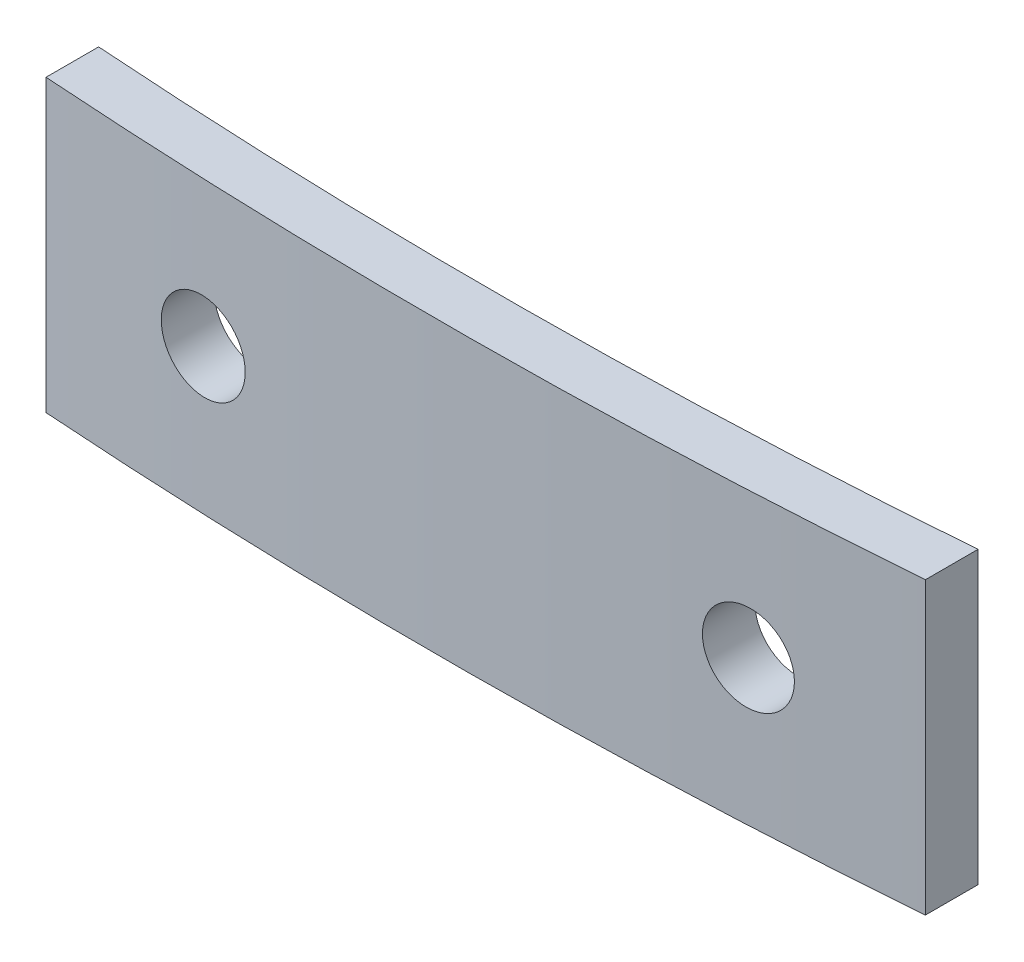
ISO-10303-21;
HEADER;
FILE_DESCRIPTION(('STEP AP214'),'2;1');
FILE_NAME('part.step','',(''),(''),'','','');
FILE_SCHEMA(('AUTOMOTIVE_DESIGN { 1 0 10303 214 1 1 1 1 }'));
ENDSEC;
DATA;
#1=APPLICATION_CONTEXT('core data for automotive mechanical design processes');
#2=APPLICATION_PROTOCOL_DEFINITION('international standard','automotive_design',2000,#1);
#3=PRODUCT_CONTEXT('',#1,'mechanical');
#4=PRODUCT('Part','Part','',(#3));
#5=PRODUCT_RELATED_PRODUCT_CATEGORY('part','',(#4));
#6=PRODUCT_DEFINITION_FORMATION('','',#4);
#7=PRODUCT_DEFINITION_CONTEXT('part definition',#1,'design');
#8=PRODUCT_DEFINITION('design','',#6,#7);
#9=PRODUCT_DEFINITION_SHAPE('','',#8);
#10=(LENGTH_UNIT() NAMED_UNIT(*) SI_UNIT(.MILLI.,.METRE.));
#11=(NAMED_UNIT(*) PLANE_ANGLE_UNIT() SI_UNIT($,.RADIAN.));
#12=(NAMED_UNIT(*) SI_UNIT($,.STERADIAN.) SOLID_ANGLE_UNIT());
#13=UNCERTAINTY_MEASURE_WITH_UNIT(LENGTH_MEASURE(1.E-05),#10,'distance_accuracy_value','');
#14=(GEOMETRIC_REPRESENTATION_CONTEXT(3) GLOBAL_UNCERTAINTY_ASSIGNED_CONTEXT((#13)) GLOBAL_UNIT_ASSIGNED_CONTEXT((#10,
#11,#12)) REPRESENTATION_CONTEXT('',''));
#15=CARTESIAN_POINT('',(0.,0.,0.));
#16=DIRECTION('',(0.,0.,1.));
#17=DIRECTION('',(1.,0.,0.));
#18=AXIS2_PLACEMENT_3D('',#15,#16,#17);
#19=CARTESIAN_POINT('',(-0.864955357188,8.3,-164.510629845193));
#20=DIRECTION('',(0.,-1.,0.));
#21=DIRECTION('',(0.,0.,-1.));
#22=AXIS2_PLACEMENT_3D('',#19,#20,#21);
#23=CYLINDRICAL_SURFACE('',#22,167.210703971618);
#24=CARTESIAN_POINT('',(-0.864955357188,0.,-164.510629845193));
#25=DIRECTION('',(0.,-1.,0.));
#26=DIRECTION('',(0.,0.,1.));
#27=AXIS2_PLACEMENT_3D('',#24,#25,#26);
#28=CIRCLE('',#27,167.210703971618);
#29=CARTESIAN_POINT('',(12.5,0.,2.16509571490275));
#30=VERTEX_POINT('',#29);
#31=CARTESIAN_POINT('',(-12.5,0.,2.29478151440213));
#32=VERTEX_POINT('',#31);
#33=EDGE_CURVE('E117',#30,#32,#28,.T.);
#34=ORIENTED_EDGE('',*,*,#33,.T.);
#35=DIRECTION('',(0.,-1.,0.));
#36=VECTOR('',#35,1.);
#37=CARTESIAN_POINT('',(-12.5,8.3,2.29478151440213));
#38=LINE('',#37,#36);
#39=CARTESIAN_POINT('',(-12.5,8.3,2.29478151440213));
#40=VERTEX_POINT('',#39);
#41=EDGE_CURVE('E11',#40,#32,#38,.T.);
#42=ORIENTED_EDGE('',*,*,#41,.F.);
#43=CARTESIAN_POINT('',(-0.864955357188,8.3,-164.510629845193));
#44=DIRECTION('',(0.,-1.,0.));
#45=DIRECTION('',(0.,0.,1.));
#46=AXIS2_PLACEMENT_3D('',#43,#44,#45);
#47=CIRCLE('',#46,167.210703971618);
#48=CARTESIAN_POINT('',(12.5,8.3,2.16509571490275));
#49=VERTEX_POINT('',#48);
#50=EDGE_CURVE('E99',#49,#40,#47,.T.);
#51=ORIENTED_EDGE('',*,*,#50,.F.);
#52=DIRECTION('',(0.,-1.,0.));
#53=VECTOR('',#52,1.);
#54=CARTESIAN_POINT('',(12.5,8.3,2.16509571490275));
#55=LINE('',#54,#53);
#56=EDGE_CURVE('E113',#49,#30,#55,.T.);
#57=ORIENTED_EDGE('',*,*,#56,.T.);
#58=EDGE_LOOP('',(#34,#42,#51,#57));
#59=FACE_BOUND('',#58,.T.);
#60=CARTESIAN_POINT('',(6.5,4.15,2.53779713115004));
#61=CARTESIAN_POINT('',(6.50000311830072,4.2201600528483,2.53779703356888));
#62=CARTESIAN_POINT('',(6.50592683250922,4.29037097447346,2.53753615101918));
#63=CARTESIAN_POINT('',(6.52947445822004,4.42885834488722,2.53649543364698));
#64=CARTESIAN_POINT('',(6.54711244591845,4.49713236319745,2.5357149744841));
#65=CARTESIAN_POINT('',(6.593583155423,4.6297187466707,2.53364651229168));
#66=CARTESIAN_POINT('',(6.62241033254543,4.69403305576497,2.53235876064082));
#67=CARTESIAN_POINT('',(6.69042977820944,4.81688874962342,2.52929601535595));
#68=CARTESIAN_POINT('',(6.72961948369922,4.87543155699319,2.52752114220171));
#69=CARTESIAN_POINT('',(6.81727240701778,4.98513523567161,2.52351282987057));
#70=CARTESIAN_POINT('',(6.86574015724651,5.03629247755706,2.52127916653188));
#71=CARTESIAN_POINT('',(6.97055942325953,5.12974635220956,2.51639484759461));
#72=CARTESIAN_POINT('',(7.02691128046353,5.17204260105485,2.51374417393686));
#73=CARTESIAN_POINT('',(7.14595131480201,5.24661412268197,2.50807702763504));
#74=CARTESIAN_POINT('',(7.2086452692116,5.27888014756526,2.50506022095671));
#75=CARTESIAN_POINT('',(7.33854573429652,5.33243009041771,2.49873012293615));
#76=CARTESIAN_POINT('',(7.40575226418267,5.35371396163058,2.4954168303317));
#77=CARTESIAN_POINT('',(7.5428494216453,5.38471994256582,2.4885709153848));
#78=CARTESIAN_POINT('',(7.61274294738313,5.39442918509865,2.48503805353334));
#79=CARTESIAN_POINT('',(7.7531616222027,5.40197190758309,2.47785036870086));
#80=CARTESIAN_POINT('',(7.82368677376782,5.39980534082174,2.47419554524016));
#81=CARTESIAN_POINT('',(7.96342985722233,5.38365274089719,2.46686575840938));
#82=CARTESIAN_POINT('',(8.0326466378837,5.36965675272819,2.46319078066725));
#83=CARTESIAN_POINT('',(8.16774794433558,5.33022812559369,2.45593678797151));
#84=CARTESIAN_POINT('',(8.23363245930642,5.30479544949665,2.45235777332949));
#85=CARTESIAN_POINT('',(8.36020377089505,5.24320862112569,2.44541222559091));
#86=CARTESIAN_POINT('',(8.42089009855844,5.20705350283695,2.4420457116723));
#87=CARTESIAN_POINT('',(8.53533088617573,5.12504404492505,2.43564124626815));
#88=CARTESIAN_POINT('',(8.58908537368798,5.07918974386402,2.4326032934764));
#89=CARTESIAN_POINT('',(8.68808413564137,4.97912437454379,2.42696754118702));
#90=CARTESIAN_POINT('',(8.73333590873341,4.92492074717713,2.42436935405706));
#91=CARTESIAN_POINT('',(8.81409389396076,4.80966323539121,2.41970643279685));
#92=CARTESIAN_POINT('',(8.8496001867816,4.74860940769255,2.41764169425003));
#93=CARTESIAN_POINT('',(8.90980168821073,4.62148553155661,2.41412733536457));
#94=CARTESIAN_POINT('',(8.93451353604402,4.55542338906069,2.41267676841059));
#95=CARTESIAN_POINT('',(8.97249675193018,4.4200775166296,2.41044259271686));
#96=CARTESIAN_POINT('',(8.98576822175059,4.3507938153575,2.40965897804425));
#97=CARTESIAN_POINT('',(9.00047882200267,4.21107570744998,2.4087901949542));
#98=CARTESIAN_POINT('',(9.00193452056621,4.14064305088972,2.40870404854379));
#99=CARTESIAN_POINT('',(8.9930154142881,4.00053370594098,2.40923102871897));
#100=CARTESIAN_POINT('',(8.98264065708287,3.93085701450969,2.40984415248887));
#101=CARTESIAN_POINT('',(8.9503655620009,3.79426844369779,2.41174509717095));
#102=CARTESIAN_POINT('',(8.92847026623645,3.72735536859114,2.4130326229213));
#103=CARTESIAN_POINT('',(8.8737837915955,3.59815694385367,2.4162320685688));
#104=CARTESIAN_POINT('',(8.84099258100937,3.53587160769127,2.41814399028308));
#105=CARTESIAN_POINT('',(8.76541982221783,3.41764155961199,2.42252092143321));
#106=CARTESIAN_POINT('',(8.72263037518888,3.36170191310341,2.42498636810516));
#107=CARTESIAN_POINT('',(8.62829367522125,3.2577981137888,2.43037761471364));
#108=CARTESIAN_POINT('',(8.57674634798289,3.20983402865227,2.43330341855572));
#109=CARTESIAN_POINT('',(8.46627103909551,3.12316384761996,2.43951479784418));
#110=CARTESIAN_POINT('',(8.40733179566604,3.08447214599152,2.4428009212656));
#111=CARTESIAN_POINT('',(8.28380750137,3.01753168134166,2.44961536945369));
#112=CARTESIAN_POINT('',(8.21922240939069,2.98928299437351,2.45314369598402));
#113=CARTESIAN_POINT('',(8.08614019581266,2.94399119053169,2.46033126551108));
#114=CARTESIAN_POINT('',(8.0176376688324,2.92696398359887,2.46399068666331));
#115=CARTESIAN_POINT('',(7.87874601955412,2.90466003783105,2.47132140491645));
#116=CARTESIAN_POINT('',(7.80835688551057,2.89938337216909,2.47499270209117));
#117=CARTESIAN_POINT('',(7.66764528599877,2.90073180929488,2.48224190393867));
#118=CARTESIAN_POINT('',(7.59732288570206,2.90736404166644,2.48581975136414));
#119=CARTESIAN_POINT('',(7.45878462599334,2.93235966108019,2.49278235889512));
#120=CARTESIAN_POINT('',(7.39056876893537,2.95072306123143,2.49616711878486));
#121=CARTESIAN_POINT('',(7.25820669782941,2.99865642610158,2.5026575116878));
#122=CARTESIAN_POINT('',(7.19405912200034,3.02822261753584,2.50576323824877));
#123=CARTESIAN_POINT('',(7.07163847251114,3.09772642357956,2.51162544242854));
#124=CARTESIAN_POINT('',(7.01336514139768,3.13766358338107,2.51438193535473));
#125=CARTESIAN_POINT('',(6.9044123768105,3.2267300456736,2.5194854771111));
#126=CARTESIAN_POINT('',(6.85372481706355,3.27584938297113,2.52183296453855));
#127=CARTESIAN_POINT('',(6.76130334568271,3.38193224768082,2.5260782387648));
#128=CARTESIAN_POINT('',(6.71957161192582,3.43889767758814,2.52797591619053));
#129=CARTESIAN_POINT('',(6.64629504219877,3.55899830925378,2.53128701689445));
#130=CARTESIAN_POINT('',(6.614743919168,3.62212967172133,2.53270073907335));
#131=CARTESIAN_POINT('',(6.56272376021015,3.75275215207936,2.53502196922212));
#132=CARTESIAN_POINT('',(6.54224136968559,3.82023790573416,2.5359300872515));
#133=CARTESIAN_POINT('',(6.51840966169869,3.93179630078508,2.53698468836411));
#134=CARTESIAN_POINT('',(6.51151470431355,3.97514204431732,2.53728912928755));
#135=CARTESIAN_POINT('',(6.50230890007655,4.06231856832874,2.53769538112666));
#136=CARTESIAN_POINT('',(6.49999805103457,4.10614934857616,2.53779719213913));
#137=CARTESIAN_POINT('',(6.5,4.15,2.53779713115004));
#138=B_SPLINE_CURVE_WITH_KNOTS('',3,(#60,#61,#62,#63,#64,#65,#66,#67,#68,#69,#70,#71,#72,#73,
#74,#75,#76,#77,#78,#79,#80,#81,#82,#83,#84,#85,#86,#87,#88,#89,#90,#91,#92,#93,#94,#95,#96,#97,
#98,#99,#100,#101,#102,#103,#104,#105,#106,#107,#108,#109,#110,#111,#112,#113,#114,#115,#116,
#117,#118,#119,#120,#121,#122,#123,#124,#125,#126,#127,#128,#129,#130,#131,#132,#133,#134,#135,
#136,#137),.UNSPECIFIED.,.T.,.F.,(4,2,2,2,2,2,2,2,2,2,2,2,2,2,2,2,2,2,2,2,2,2,2,2,2,2,2,2,2,2,2,
2,2,2,2,2,2,2,4),(0.,0.210320035472163,0.420893255693905,0.631362261542145,0.841779258925773,
1.05229931024653,1.2628284809202,1.47355118835342,1.68427479292679,1.89523243521323,
2.10619090729285,2.31732708766128,2.52846395353147,2.7396198470939,2.95077490115542,
3.1617428517856,3.37270905570111,3.58334890570873,3.79398688195663,4.00432944949815,
4.21467117007918,4.424920908374,4.63517125854935,4.84558827603943,5.05600707874424,
5.26675044568951,5.47749534738359,5.68853840640857,5.89958277963837,6.11075354241696,
6.32192454116966,6.53302447718547,6.74411515719746,6.95497806183269,7.16589218613083,
7.3766758095064,7.58720454814038,7.71865648688288,7.8501083628226),.UNSPECIFIED.);
#139=CARTESIAN_POINT('',(6.5,4.15,2.53779713115004));
#140=VERTEX_POINT('',#139);
#141=EDGE_CURVE('E138',#140,#140,#138,.T.);
#142=ORIENTED_EDGE('',*,*,#141,.F.);
#143=EDGE_LOOP('',(#142));
#144=FACE_BOUND('',#143,.T.);
#145=CARTESIAN_POINT('',(-9.,4.15,2.50206599360675));
#146=CARTESIAN_POINT('',(-8.9999968789846,4.22015392659101,2.50206618554172));
#147=CARTESIAN_POINT('',(-8.99407417658717,4.29035873068543,2.50235496193518));
#148=CARTESIAN_POINT('',(-8.97053082535261,4.42883359318577,2.50349920546083));
#149=CARTESIAN_POINT('',(-8.95289609973919,4.4971012202016,2.50435535452016));
#150=CARTESIAN_POINT('',(-8.90643478571085,4.62967430947023,2.50659881430219));
#151=CARTESIAN_POINT('',(-8.87761385256324,4.69398175481704,2.5079858566231));
#152=CARTESIAN_POINT('',(-8.80960947329652,4.81682546464163,2.51123443252684));
#153=CARTESIAN_POINT('',(-8.77042857227543,4.87536314171671,2.51309584956758));
#154=CARTESIAN_POINT('',(-8.68278601070888,4.9850703860922,2.51722102597792));
#155=CARTESIAN_POINT('',(-8.63431808054086,5.036234934716,2.51948505707536));
#156=CARTESIAN_POINT('',(-8.52949361157527,5.12970468199198,2.5243279425006));
#157=CARTESIAN_POINT('',(-8.47313672058647,5.17200948490304,2.52690681088319));
#158=CARTESIAN_POINT('',(-8.35407035350533,5.24660359631099,2.53228748153317));
#159=CARTESIAN_POINT('',(-8.29135420853412,5.27888224334472,2.53508951715917));
#160=CARTESIAN_POINT('',(-8.16139801259883,5.33245139876033,2.54081634269377));
#161=CARTESIAN_POINT('',(-8.09415794839092,5.35374187497259,2.54374113296173));
#162=CARTESIAN_POINT('',(-7.95700562805629,5.38474509749862,2.54961993904171));
#163=CARTESIAN_POINT('',(-7.88709133618139,5.39444883483721,2.55257397579667));
#164=CARTESIAN_POINT('',(-7.74662363106475,5.40197266553775,2.55841906921826));
#165=CARTESIAN_POINT('',(-7.67607021805432,5.39979276320068,2.56131012590768));
#166=CARTESIAN_POINT('',(-7.53631737546828,5.38360795028121,2.56694897423169));
#167=CARTESIAN_POINT('',(-7.46711812818554,5.36960145869888,2.56969674665963));
#168=CARTESIAN_POINT('',(-7.33204995513501,5.33015574247033,2.57497929333489));
#169=CARTESIAN_POINT('',(-7.26618102694138,5.30471652615198,2.57751406773735));
#170=CARTESIAN_POINT('',(-7.13967529197927,5.24313791888805,2.58231262134722));
#171=CARTESIAN_POINT('',(-7.07903622405426,5.20700318245829,2.58457651783571));
#172=CARTESIAN_POINT('',(-6.96468446660637,5.12505256805409,2.58878998227595));
#173=CARTESIAN_POINT('',(-6.9109717504013,5.0792367273757,2.59073955143857));
#174=CARTESIAN_POINT('',(-6.81203747553293,4.97925802415904,2.59428986539865));
#175=CARTESIAN_POINT('',(-6.76681012773489,4.9251008987258,2.59589084813945));
#176=CARTESIAN_POINT('',(-6.68608977992854,4.80995352949493,2.59872223701323));
#177=CARTESIAN_POINT('',(-6.65059674771484,4.7489633083051,2.59995264437223));
#178=CARTESIAN_POINT('',(-6.590376060798,4.62192237655231,2.6020267438483));
#179=CARTESIAN_POINT('',(-6.56564166867781,4.55587486360173,2.60287067800525));
#180=CARTESIAN_POINT('',(-6.52761073193537,4.42056138087808,2.60416370089424));
#181=CARTESIAN_POINT('',(-6.51431415871405,4.35129541915288,2.60461279061355));
#182=CARTESIAN_POINT('',(-6.49954079239336,4.21154064500586,2.60511156027287));
#183=CARTESIAN_POINT('',(-6.49805932903814,4.14105232679781,2.60516139802852));
#184=CARTESIAN_POINT('',(-6.50694607500547,4.00082757280868,2.60486160439767));
#185=CARTESIAN_POINT('',(-6.51731427167745,3.93109113622496,2.60451197343762));
#186=CARTESIAN_POINT('',(-6.54960324564899,3.7943571841506,2.60341671966623));
#187=CARTESIAN_POINT('',(-6.5715228123632,3.72735938244327,2.60267113835048));
#188=CARTESIAN_POINT('',(-6.62628963110505,3.59799583377631,2.60079195620987));
#189=CARTESIAN_POINT('',(-6.65913688578675,3.53563008794169,2.59965835529077));
#190=CARTESIAN_POINT('',(-6.73483166859743,3.41728730499127,2.59701660989913));
#191=CARTESIAN_POINT('',(-6.77768113562152,3.36131150968244,2.59550839280487));
#192=CARTESIAN_POINT('',(-6.87215792978473,3.25734839500569,2.59213873834546));
#193=CARTESIAN_POINT('',(-6.92378527798313,3.20936109480376,2.59027730013288));
#194=CARTESIAN_POINT('',(-7.0343770124007,3.12271195576185,2.58623073710219));
#195=CARTESIAN_POINT('',(-7.09334487425577,3.08405456016075,2.58404545885613));
#196=CARTESIAN_POINT('',(-7.21692291467281,3.01718732082311,2.57939334339435));
#197=CARTESIAN_POINT('',(-7.28153310692913,2.98897750244451,2.57692650549527));
#198=CARTESIAN_POINT('',(-7.41460725247868,2.94378577926695,2.57176305079366));
#199=CARTESIAN_POINT('',(-7.48307375578416,2.92681140084984,2.56906628132723));
#200=CARTESIAN_POINT('',(-7.62187848301808,2.90459846176945,2.56351038955912));
#201=CARTESIAN_POINT('',(-7.69221671793101,2.89935996999512,2.56065126630453));
#202=CARTESIAN_POINT('',(-7.83281637138237,2.90076536385271,2.55484650857032));
#203=CARTESIAN_POINT('',(-7.90307771107605,2.90741691833229,2.55190081946276));
#204=CARTESIAN_POINT('',(-8.04148512738746,2.93242782586422,2.54601247447333));
#205=CARTESIAN_POINT('',(-8.10963119421408,2.95078723310107,2.54306981860556));
#206=CARTESIAN_POINT('',(-8.241895354265,2.99870164424562,2.53728144363261));
#207=CARTESIAN_POINT('',(-8.30601218718679,3.02826013098761,2.53443575498392));
#208=CARTESIAN_POINT('',(-8.42837082553149,3.09773467630274,2.52894039080036));
#209=CARTESIAN_POINT('',(-8.48661286568478,3.13765032082243,2.52629070743512));
#210=CARTESIAN_POINT('',(-8.5955437277431,3.22668945212403,2.52128478020098));
#211=CARTESIAN_POINT('',(-8.64623586141244,3.27580888019099,2.51892840774627));
#212=CARTESIAN_POINT('',(-8.73866512901045,3.38189143455903,2.51459688510446));
#213=CARTESIAN_POINT('',(-8.78040007437305,3.43885647225799,2.51262182809836));
#214=CARTESIAN_POINT('',(-8.85368941957521,3.55896764454512,2.50913246037367));
#215=CARTESIAN_POINT('',(-8.88524832561627,3.62211102701864,2.5076179457325));
#216=CARTESIAN_POINT('',(-8.93727980646051,3.75276028135037,2.50511128627954));
#217=CARTESIAN_POINT('',(-8.95776576458918,3.82026077596767,2.50411851090768));
#218=CARTESIAN_POINT('',(-8.98159577176555,3.931828323578,2.50296166374095));
#219=CARTESIAN_POINT('',(-8.9884886838119,3.97516767163756,2.50262636687851));
#220=CARTESIAN_POINT('',(-8.9976917716211,4.06233138927276,2.50217847191128));
#221=CARTESIAN_POINT('',(-9.00000195054731,4.10615575851357,2.50206587365277));
#222=CARTESIAN_POINT('',(-9.,4.15,2.50206599360675));
#223=B_SPLINE_CURVE_WITH_KNOTS('',3,(#145,#146,#147,#148,#149,#150,#151,#152,#153,#154,#155,
#156,#157,#158,#159,#160,#161,#162,#163,#164,#165,#166,#167,#168,#169,#170,#171,#172,#173,#174,
#175,#176,#177,#178,#179,#180,#181,#182,#183,#184,#185,#186,#187,#188,#189,#190,#191,#192,#193,
#194,#195,#196,#197,#198,#199,#200,#201,#202,#203,#204,#205,#206,#207,#208,#209,#210,#211,#212,
#213,#214,#215,#216,#217,#218,#219,#220,#221,#222),.UNSPECIFIED.,.T.,.F.,(4,2,2,2,2,2,2,2,2,2,2,
2,2,2,2,2,2,2,2,2,2,2,2,2,2,2,2,2,2,2,2,2,2,2,2,2,2,2,4),(0.,0.210301643941587,
0.420856509681721,0.631305066265064,0.841701970625624,1.05224141643252,1.26279026446753,
1.47356224230451,1.68433483720616,1.89527120650513,2.10620749946128,2.3171719952294,
2.52813633732614,2.73900900582891,2.94988086196861,3.16060832361605,3.37133508807649,
3.58192969779077,3.79252378093362,4.00303461668978,4.21354522770696,4.42403378156556,
4.6345223865464,4.84505182796709,5.05558177448261,5.26621178602277,5.47684230879222,
5.68761378604787,5.89838650051611,6.10929520832399,6.32020489223412,6.53118022147071,
6.74214711773653,6.95302119914314,7.16394674622767,7.37477876158737,7.58535538162698,
7.71678811639713,7.84822076044173),.UNSPECIFIED.);
#224=CARTESIAN_POINT('',(-9.,4.15,2.50206599360675));
#225=VERTEX_POINT('',#224);
#226=EDGE_CURVE('E121',#225,#225,#223,.T.);
#227=ORIENTED_EDGE('',*,*,#226,.F.);
#228=EDGE_LOOP('',(#227));
#229=FACE_BOUND('',#228,.T.);
#230=ADVANCED_FACE('F39',(#59,#144,#229),#23,.F.);
#231=CARTESIAN_POINT('',(-0.864955357188,8.3,-164.510629845193));
#232=DIRECTION('',(0.,-1.,0.));
#233=DIRECTION('',(0.,0.,-1.));
#234=AXIS2_PLACEMENT_3D('',#231,#232,#233);
#235=CYLINDRICAL_SURFACE('',#234,168.710703971618);
#236=CARTESIAN_POINT('',(-0.864955357188,0.,-164.510629845193));
#237=DIRECTION('',(0.,1.,0.));
#238=DIRECTION('',(0.,0.,1.));
#239=AXIS2_PLACEMENT_3D('',#236,#237,#238);
#240=CIRCLE('',#239,168.710703971618);
#241=CARTESIAN_POINT('',(-12.5,0.,3.79839359312012));
#242=VERTEX_POINT('',#241);
#243=CARTESIAN_POINT('',(12.5,0.,3.66986724914678));
#244=VERTEX_POINT('',#243);
#245=EDGE_CURVE('E81',#242,#244,#240,.T.);
#246=ORIENTED_EDGE('',*,*,#245,.T.);
#247=DIRECTION('',(0.,-1.,0.));
#248=VECTOR('',#247,1.);
#249=CARTESIAN_POINT('',(12.5,8.3,3.66986724914678));
#250=LINE('',#249,#248);
#251=CARTESIAN_POINT('',(12.5,8.3,3.66986724914678));
#252=VERTEX_POINT('',#251);
#253=EDGE_CURVE('E106',#252,#244,#250,.T.);
#254=ORIENTED_EDGE('',*,*,#253,.F.);
#255=CARTESIAN_POINT('',(-0.864955357188,8.3,-164.510629845193));
#256=DIRECTION('',(0.,1.,0.));
#257=DIRECTION('',(0.,0.,1.));
#258=AXIS2_PLACEMENT_3D('',#255,#256,#257);
#259=CIRCLE('',#258,168.710703971618);
#260=CARTESIAN_POINT('',(-12.5,8.3,3.79839359312012));
#261=VERTEX_POINT('',#260);
#262=EDGE_CURVE('E97',#261,#252,#259,.T.);
#263=ORIENTED_EDGE('',*,*,#262,.F.);
#264=DIRECTION('',(0.,-1.,0.));
#265=VECTOR('',#264,1.);
#266=CARTESIAN_POINT('',(-12.5,8.3,3.79839359312012));
#267=LINE('',#266,#265);
#268=EDGE_CURVE('E55',#261,#242,#267,.T.);
#269=ORIENTED_EDGE('',*,*,#268,.T.);
#270=EDGE_LOOP('',(#246,#254,#263,#269));
#271=FACE_BOUND('',#270,.T.);
#272=CARTESIAN_POINT('',(6.5,4.15,4.03924131223474));
#273=CARTESIAN_POINT('',(6.50000311821644,4.07983900859695,4.03924121552746));
#274=CARTESIAN_POINT('',(6.50592698943899,4.00962714769121,4.03898265006681));
#275=CARTESIAN_POINT('',(6.52947525777152,3.87113790994845,4.0379511752882));
#276=CARTESIAN_POINT('',(6.54711373158644,3.80286296362511,4.03717764716917));
#277=CARTESIAN_POINT('',(6.5935857873165,3.67027474837752,4.03512755161364));
#278=CARTESIAN_POINT('',(6.62241382786342,3.60595953672604,4.0338512331675));
#279=CARTESIAN_POINT('',(6.69043542031096,3.48310215407869,4.03081567544882));
#280=CARTESIAN_POINT('',(6.72962640880317,3.42455856030873,4.02905655559933));
#281=CARTESIAN_POINT('',(6.8172820530594,3.31485390784877,4.02508382682745));
#282=CARTESIAN_POINT('',(6.86575117837123,3.26369642818558,4.02286999882126));
#283=CARTESIAN_POINT('',(6.97057354743463,3.17024232360844,4.01802904805094));
#284=CARTESIAN_POINT('',(7.02692713205723,3.12794608199243,4.01540190741733));
#285=CARTESIAN_POINT('',(7.14596995548139,3.0533755885601,4.00978511600479));
#286=CARTESIAN_POINT('',(7.20866486743313,3.02111041785869,4.00679514013584));
#287=CARTESIAN_POINT('',(7.33856734711277,2.96756235584867,4.00052134139237));
#288=CARTESIAN_POINT('',(7.40577493355283,2.9462795100823,3.99723751729937));
#289=CARTESIAN_POINT('',(7.54287287382637,2.91527615684631,3.99045256076157));
#290=CARTESIAN_POINT('',(7.61276607455011,2.90556828916056,3.98695119514311));
#291=CARTESIAN_POINT('',(7.75318398462447,2.8980281750774,3.97982760071568));
#292=CARTESIAN_POINT('',(7.82370869639393,2.90019597418601,3.97620537144363));
#293=CARTESIAN_POINT('',(7.96344967877755,2.91635077058775,3.96894102179305));
#294=CARTESIAN_POINT('',(8.03266481846192,2.93034754597473,3.96529888743592));
#295=CARTESIAN_POINT('',(8.16776273741988,2.96977719915022,3.95810974015303));
#296=CARTESIAN_POINT('',(8.23364550600481,2.99521011361783,3.9545627275324));
#297=CARTESIAN_POINT('',(8.36021317750195,3.05679674125216,3.9476793053207));
#298=CARTESIAN_POINT('',(8.42089762011192,3.09295140254778,3.94434291438667));
#299=CARTESIAN_POINT('',(8.53533475109379,3.17495920939542,3.93799576571535));
#300=CARTESIAN_POINT('',(8.58908746658606,3.22081231700043,3.93498500670404));
#301=CARTESIAN_POINT('',(8.68808377782325,3.32087531831846,3.92939965986203));
#302=CARTESIAN_POINT('',(8.73333473937803,3.37507790335134,3.92682469465888));
#303=CARTESIAN_POINT('',(8.81409134650165,3.49033280947923,3.92220344736396));
#304=CARTESIAN_POINT('',(8.84959707129266,3.5513850748853,3.92015716097439));
#305=CARTESIAN_POINT('',(8.9097987203869,3.67850714182677,3.91667414586706));
#306=CARTESIAN_POINT('',(8.93451098835277,3.74456917818108,3.91523649564265));
#307=CARTESIAN_POINT('',(8.97249503617838,3.87991472439955,3.91302220369957));
#308=CARTESIAN_POINT('',(8.98576691600336,3.9491982061094,3.91224555620512));
#309=CARTESIAN_POINT('',(9.00047858396002,4.08891761505717,3.91138446160088));
#310=CARTESIAN_POINT('',(9.00193464639936,4.15935182324617,3.91129906241283));
#311=CARTESIAN_POINT('',(8.9930157402488,4.29946432254685,3.91182132938166));
#312=CARTESIAN_POINT('',(8.98264081844691,4.36914261664685,3.91242899279767));
#313=CARTESIAN_POINT('',(8.95036468700418,4.50573494537357,3.914313038854));
#314=CARTESIAN_POINT('',(8.92846843044031,4.5726501545421,3.9155891341312));
#315=CARTESIAN_POINT('',(8.87377921065577,4.70185269258961,3.9187601956958));
#316=CARTESIAN_POINT('',(8.84098621630991,4.76414000824897,3.92065516375093));
#317=CARTESIAN_POINT('',(8.76540956464805,4.88237282754171,3.92499327057981));
#318=CARTESIAN_POINT('',(8.72261814798466,4.93831335535867,3.92743683503776));
#319=CARTESIAN_POINT('',(8.62827692294248,5.04221853556737,3.93278024197423));
#320=CARTESIAN_POINT('',(8.57672704150597,5.09018312142211,3.93568008825876));
#321=CARTESIAN_POINT('',(8.46624763257672,5.17685250771872,3.9418362841016));
#322=CARTESIAN_POINT('',(8.40730704222217,5.21554316817252,3.94509316715551));
#323=CARTESIAN_POINT('',(8.28378001097383,5.28248131570165,3.95184697684573));
#324=CARTESIAN_POINT('',(8.21919352979874,5.31072872826082,3.95534390519464));
#325=CARTESIAN_POINT('',(8.08611029795493,5.35601708706464,3.96246741698824));
#326=CARTESIAN_POINT('',(8.01760823799984,5.37304240537618,3.9660941738585));
#327=CARTESIAN_POINT('',(7.87871783527179,5.39534282461644,3.97335944682001));
#328=CARTESIAN_POINT('',(7.80832948090368,5.4006178532987,3.97699796298344));
#329=CARTESIAN_POINT('',(7.66762053519389,5.39926646401132,3.98418238604974));
#330=CARTESIAN_POINT('',(7.59730000806059,5.39263304400314,3.98772823722278));
#331=CARTESIAN_POINT('',(7.45876575456234,5.36763572035665,3.99462856946871));
#332=CARTESIAN_POINT('',(7.39055203058462,5.34927180342702,3.99798305032478));
#333=CARTESIAN_POINT('',(7.25819393508083,5.30133802586427,4.00441539585193));
#334=CARTESIAN_POINT('',(7.19404822705777,5.2717718680891,4.00749335151192));
#335=CARTESIAN_POINT('',(7.07163132096953,5.20226884492977,4.01330313292874));
#336=CARTESIAN_POINT('',(7.01335986592901,5.16233243347673,4.01603497382808));
#337=CARTESIAN_POINT('',(6.90440970126537,5.0732674380006,4.02109291899382));
#338=CARTESIAN_POINT('',(6.85372299555039,5.02414865901682,4.02341945098133));
#339=CARTESIAN_POINT('',(6.76130311542266,4.9180673552612,4.02762682906563));
#340=CARTESIAN_POINT('',(6.71957211975892,4.86110292731781,4.02950756672099));
#341=CARTESIAN_POINT('',(6.64629602031458,4.74100352127972,4.03278914867204));
#342=CARTESIAN_POINT('',(6.61474482710605,4.67787226166189,4.03419027989286));
#343=CARTESIAN_POINT('',(6.5627245280606,4.54725012163238,4.03649083798602));
#344=CARTESIAN_POINT('',(6.54224206886014,4.47976460478744,4.03739086942695));
#345=CARTESIAN_POINT('',(6.51841005492601,4.36820601693854,4.03843608951052));
#346=CARTESIAN_POINT('',(6.5115149493841,4.32485980916441,4.03873782494765));
#347=CARTESIAN_POINT('',(6.50230894854312,4.23768235789113,4.039140466484));
#348=CARTESIAN_POINT('',(6.49999805109272,4.19385111461962,4.03924137267747));
#349=CARTESIAN_POINT('',(6.5,4.15,4.03924131223474));
#350=B_SPLINE_CURVE_WITH_KNOTS('',3,(#272,#273,#274,#275,#276,#277,#278,#279,#280,#281,#282,
#283,#284,#285,#286,#287,#288,#289,#290,#291,#292,#293,#294,#295,#296,#297,#298,#299,#300,#301,
#302,#303,#304,#305,#306,#307,#308,#309,#310,#311,#312,#313,#314,#315,#316,#317,#318,#319,#320,
#321,#322,#323,#324,#325,#326,#327,#328,#329,#330,#331,#332,#333,#334,#335,#336,#337,#338,#339,
#340,#341,#342,#343,#344,#345,#346,#347,#348,#349),.UNSPECIFIED.,.T.,.F.,(4,2,2,2,2,2,2,2,2,2,2,
2,2,2,2,2,2,2,2,2,2,2,2,2,2,2,2,2,2,2,2,2,2,2,2,2,2,2,4),(0.,0.21032285065951,0.420898891500716,
0.631370782317331,0.841790658830802,1.0523121569659,1.26284275944984,1.47356340371594,
1.68428492180584,1.89523633598718,2.10618855850775,2.31731532956252,2.52844277776863,
2.73958890164003,2.95073419937742,3.16169571135771,3.372655508313,3.58329474891462,
3.79393214894812,4.0042793819482,4.21462578309076,4.42488182910303,4.63513847569105,
4.84555883861547,5.05598095682341,5.26672189415471,5.47746433516598,5.68849964034594,
5.89953624306924,6.11069697366875,6.32185794352577,6.53294917573722,6.74403116953091,
6.95488904180111,7.16579815365963,7.37658086745767,7.58710872125055,7.71856204845135,
7.85001531396198),.UNSPECIFIED.);
#351=CARTESIAN_POINT('',(6.5,4.15,4.03924131223474));
#352=VERTEX_POINT('',#351);
#353=EDGE_CURVE('E131',#352,#352,#350,.T.);
#354=ORIENTED_EDGE('',*,*,#353,.F.);
#355=EDGE_LOOP('',(#354));
#356=FACE_BOUND('',#355,.T.);
#357=CARTESIAN_POINT('',(-9.,4.15,4.00382853526263));
#358=CARTESIAN_POINT('',(-8.99999687911659,4.07984502633881,4.00382872548162));
#359=CARTESIAN_POINT('',(-8.99407400179579,4.00963917459052,4.00411493681465));
#360=CARTESIAN_POINT('',(-8.97052993227765,3.87116222315919,4.00524901773178));
#361=CARTESIAN_POINT('',(-8.95289466280278,3.80289355488584,4.00609756318996));
#362=CARTESIAN_POINT('',(-8.90643183624862,3.67031839828944,4.00832110235645));
#363=CARTESIAN_POINT('',(-8.87760992916895,3.60600992876898,4.00969583030259));
#364=CARTESIAN_POINT('',(-8.80960313648298,3.48316431773872,4.01291557040366));
#365=CARTESIAN_POINT('',(-8.77042079664787,3.42462576328645,4.01476046702447));
#366=CARTESIAN_POINT('',(-8.68277533044708,3.31491760773199,4.01884901705909));
#367=CARTESIAN_POINT('',(-8.63430602799477,3.26375295037439,4.02109293576178));
#368=CARTESIAN_POINT('',(-8.52947854701956,3.17028325362986,4.02589280206468));
#369=CARTESIAN_POINT('',(-8.47312001704397,3.12797860915227,4.02844876356526));
#370=CARTESIAN_POINT('',(-8.35405132597718,3.05338592633764,4.03378158953743));
#371=CARTESIAN_POINT('',(-8.29133461612006,3.02110835755454,4.03655868112283));
#372=CARTESIAN_POINT('',(-8.16137739190089,2.96754142454835,4.04223452149232));
#373=CARTESIAN_POINT('',(-8.09413686469101,2.94625209153383,4.04513327062191));
#374=CARTESIAN_POINT('',(-7.95698473984485,2.91525144961586,4.05095968793787));
#375=CARTESIAN_POINT('',(-7.88707114263138,2.90554899028414,4.05388737650856));
#376=CARTESIAN_POINT('',(-7.74660507509065,2.89802743411505,4.05968032894629));
#377=CARTESIAN_POINT('',(-7.67605260501102,2.90020833267169,4.06254559283754));
#378=CARTESIAN_POINT('',(-7.53630204073127,2.91639476988055,4.06813412100627));
#379=CARTESIAN_POINT('',(-7.46710412560258,2.9304018612907,4.07085736658715));
#380=CARTESIAN_POINT('',(-7.33203875687078,2.96984829741078,4.07609275666331));
#381=CARTESIAN_POINT('',(-7.26617130094693,2.99528763415434,4.0786049013057));
#382=CARTESIAN_POINT('',(-7.13966804400317,3.05686618297633,4.0833606312495));
#383=CARTESIAN_POINT('',(-7.07903002178615,3.0930008230405,4.08560433073117));
#384=CARTESIAN_POINT('',(-6.96468033953217,3.17495082904335,4.08978020395954));
#385=CARTESIAN_POINT('',(-6.910968653237,3.22076615828014,4.09171237888726));
#386=CARTESIAN_POINT('',(-6.81203568189268,3.32074403246828,4.09523103941777));
#387=CARTESIAN_POINT('',(-6.7668087103755,3.3749009422332,4.09681775666211));
#388=CARTESIAN_POINT('',(-6.68608906974859,3.49004766447824,4.09962391611695));
#389=CARTESIAN_POINT('',(-6.65059636902787,3.55103745476841,4.10084335952014));
#390=CARTESIAN_POINT('',(-6.59037587397156,3.67807805335364,4.10289899008835));
#391=CARTESIAN_POINT('',(-6.56564146166092,3.7441257207938,4.10373541288577));
#392=CARTESIAN_POINT('',(-6.52761053999915,3.87943945419578,4.10501692589379));
#393=CARTESIAN_POINT('',(-6.51431400254687,3.94870551225006,4.10546201706583));
#394=CARTESIAN_POINT('',(-6.49954068272828,4.08846093813965,4.10595634563383));
#395=CARTESIAN_POINT('',(-6.4980593128397,4.15894982052913,4.1060057366699));
#396=CARTESIAN_POINT('',(-6.50694643352966,4.2991756813677,4.10570859894667));
#397=CARTESIAN_POINT('',(-6.51731491169092,4.36891266060462,4.10536207060225));
#398=CARTESIAN_POINT('',(-6.54960467747415,4.50564779266525,4.10427653892874));
#399=CARTESIAN_POINT('',(-6.57152477595895,4.57264622663315,4.10353757599727));
#400=CARTESIAN_POINT('',(-6.62629291903029,4.70201096155937,4.1016750751069));
#401=CARTESIAN_POINT('',(-6.65914096619861,4.76437726142334,4.10055153705713));
#402=CARTESIAN_POINT('',(-6.73483748338903,4.88272081569556,4.09793324529944));
#403=CARTESIAN_POINT('',(-6.77768785801902,4.93869685026548,4.096438420889));
#404=CARTESIAN_POINT('',(-6.87216669824594,5.04266029116125,4.09309868681943));
#405=CARTESIAN_POINT('',(-6.92379518459326,5.09064767860237,4.09125377633275));
#406=CARTESIAN_POINT('',(-7.03438895685658,5.17729639056959,4.08724315742738));
#407=CARTESIAN_POINT('',(-7.09335765702355,5.21595335035499,4.08507729963233));
#408=CARTESIAN_POINT('',(-7.21693747812557,5.28281956528464,4.08046652729411));
#409=CARTESIAN_POINT('',(-7.28154861240822,5.31102879571317,4.07802161209081));
#410=CARTESIAN_POINT('',(-7.41462391435739,5.35621884561702,4.07290407615883));
#411=CARTESIAN_POINT('',(-7.48309058688707,5.37319227193467,4.07023130680495));
#412=CARTESIAN_POINT('',(-7.62189560354946,5.39540329847674,4.06472486484132));
#413=CARTESIAN_POINT('',(-7.6922339585318,5.40064083065635,4.06189119129874));
#414=CARTESIAN_POINT('',(-7.83283294164632,5.39923349667971,4.05613814320303));
#415=CARTESIAN_POINT('',(-7.90309349226969,5.39258109803718,4.0532187154756));
#416=CARTESIAN_POINT('',(-8.0414992258176,5.36756875817565,4.04738287567715));
#417=CARTESIAN_POINT('',(-8.10964439904904,5.34920876331834,4.04446646362001));
#418=CARTESIAN_POINT('',(-8.24190632413181,5.30129360135098,4.03872973741514));
#419=CARTESIAN_POINT('',(-8.30602183675092,5.27173500981302,4.03590945295017));
#420=CARTESIAN_POINT('',(-8.42837783584381,5.20226072346568,4.03046315648645));
#421=CARTESIAN_POINT('',(-8.48661855697557,5.16234544256329,4.02783713672925));
#422=CARTESIAN_POINT('',(-8.59554720868316,5.07330728731344,4.02287590753864));
#423=CARTESIAN_POINT('',(-8.6462384064779,5.02418841692206,4.02054057237749));
#424=CARTESIAN_POINT('',(-8.73866594265723,4.91810741345729,4.01624772407032));
#425=CARTESIAN_POINT('',(-8.78040009179382,4.86114336846859,4.01429030330443));
#426=CARTESIAN_POINT('',(-8.8536887365792,4.74103360551672,4.01083206211804));
#427=CARTESIAN_POINT('',(-8.88524757256399,4.67789053827158,4.00933104703078));
#428=CARTESIAN_POINT('',(-8.93727898823586,4.54724209802388,4.00684672857177));
#429=CARTESIAN_POINT('',(-8.95776494950587,4.47974210136188,4.00586280033996));
#430=CARTESIAN_POINT('',(-8.98159528779054,4.36817452940942,4.00471624674521));
#431=CARTESIAN_POINT('',(-8.98848838216598,4.3248346100846,4.00438392917407));
#432=CARTESIAN_POINT('',(-8.99769171194752,4.23766975108637,4.00394001406694));
#433=CARTESIAN_POINT('',(-9.00000195046108,4.19384481174185,4.00382841638131));
#434=CARTESIAN_POINT('',(-9.,4.15,4.00382853526263));
#435=B_SPLINE_CURVE_WITH_KNOTS('',3,(#357,#358,#359,#360,#361,#362,#363,#364,#365,#366,#367,
#368,#369,#370,#371,#372,#373,#374,#375,#376,#377,#378,#379,#380,#381,#382,#383,#384,#385,#386,
#387,#388,#389,#390,#391,#392,#393,#394,#395,#396,#397,#398,#399,#400,#401,#402,#403,#404,#405,
#406,#407,#408,#409,#410,#411,#412,#413,#414,#415,#416,#417,#418,#419,#420,#421,#422,#423,#424,
#425,#426,#427,#428,#429,#430,#431,#432,#433,#434),.UNSPECIFIED.,.T.,.F.,(4,2,2,2,2,2,2,2,2,2,2,
2,2,2,2,2,2,2,2,2,2,2,2,2,2,2,2,2,2,2,2,2,2,2,2,2,2,2,4),(0.,0.210304784924288,
0.420862796470645,0.631314600245847,0.841714739667695,1.05225528970966,1.26280522198902,
1.47357426219802,1.6843439010257,1.89527441418617,2.10620484558988,2.31716297608868,
2.52812095958496,2.73898889296234,2.94985602690159,3.16058132853005,3.37130594584302,
3.58190075166872,3.79249504009312,4.00300755625049,4.21351985181548,4.4240104812328,
4.63450116037917,4.84503195316071,5.0555632436183,5.26619282980732,5.47682291427,
5.68759145590011,5.89836121956493,6.10926455702065,6.32016886073649,6.53113770917181,
6.74209812749672,6.95296698118833,7.16388731610166,7.37471756238857,7.58529244713095,
7.71672689111227,7.8481612459728),.UNSPECIFIED.);
#436=CARTESIAN_POINT('',(-9.,4.15,4.00382853526263));
#437=VERTEX_POINT('',#436);
#438=EDGE_CURVE('E43',#437,#437,#435,.T.);
#439=ORIENTED_EDGE('',*,*,#438,.F.);
#440=EDGE_LOOP('',(#439));
#441=FACE_BOUND('',#440,.T.);
#442=ADVANCED_FACE('F108',(#271,#356,#441),#235,.T.);
#443=CARTESIAN_POINT('',(-12.5,8.3,2.29478151440213));
#444=DIRECTION('',(1.,0.,0.));
#445=DIRECTION('',(0.,0.,-1.));
#446=AXIS2_PLACEMENT_3D('',#443,#444,#445);
#447=PLANE('',#446);
#448=DIRECTION('',(0.,0.,1.));
#449=VECTOR('',#448,1.);
#450=CARTESIAN_POINT('',(-12.5,0.,2.29478151440213));
#451=LINE('',#450,#449);
#452=EDGE_CURVE('E104',#32,#242,#451,.T.);
#453=ORIENTED_EDGE('',*,*,#452,.T.);
#454=ORIENTED_EDGE('',*,*,#268,.F.);
#455=DIRECTION('',(0.,0.,1.));
#456=VECTOR('',#455,1.);
#457=CARTESIAN_POINT('',(-12.5,8.3,2.29478151440213));
#458=LINE('',#457,#456);
#459=EDGE_CURVE('E94',#40,#261,#458,.T.);
#460=ORIENTED_EDGE('',*,*,#459,.F.);
#461=ORIENTED_EDGE('',*,*,#41,.T.);
#462=EDGE_LOOP('',(#453,#454,#460,#461));
#463=FACE_BOUND('',#462,.T.);
#464=ADVANCED_FACE('F103',(#463),#447,.F.);
#465=CARTESIAN_POINT('',(12.5,8.3,2.16509571490275));
#466=DIRECTION('',(-1.,0.,0.));
#467=DIRECTION('',(0.,0.,1.));
#468=AXIS2_PLACEMENT_3D('',#465,#466,#467);
#469=PLANE('',#468);
#470=DIRECTION('',(0.,0.,-1.));
#471=VECTOR('',#470,1.);
#472=CARTESIAN_POINT('',(12.5,0.,2.16509571490275));
#473=LINE('',#472,#471);
#474=EDGE_CURVE('E87',#244,#30,#473,.T.);
#475=ORIENTED_EDGE('',*,*,#474,.T.);
#476=ORIENTED_EDGE('',*,*,#56,.F.);
#477=DIRECTION('',(0.,0.,-1.));
#478=VECTOR('',#477,1.);
#479=CARTESIAN_POINT('',(12.5,8.3,2.16509571490275));
#480=LINE('',#479,#478);
#481=EDGE_CURVE('E64',#252,#49,#480,.T.);
#482=ORIENTED_EDGE('',*,*,#481,.F.);
#483=ORIENTED_EDGE('',*,*,#253,.T.);
#484=EDGE_LOOP('',(#475,#476,#482,#483));
#485=FACE_BOUND('',#484,.T.);
#486=ADVANCED_FACE('F175',(#485),#469,.F.);
#487=CARTESIAN_POINT('',(-0.864955357188,8.3,-164.510629845193));
#488=DIRECTION('',(0.,1.,0.));
#489=DIRECTION('',(0.,0.,1.));
#490=AXIS2_PLACEMENT_3D('',#487,#488,#489);
#491=PLANE('',#490);
#492=ORIENTED_EDGE('',*,*,#50,.T.);
#493=ORIENTED_EDGE('',*,*,#459,.T.);
#494=ORIENTED_EDGE('',*,*,#262,.T.);
#495=ORIENTED_EDGE('',*,*,#481,.T.);
#496=EDGE_LOOP('',(#492,#493,#494,#495));
#497=FACE_BOUND('',#496,.T.);
#498=ADVANCED_FACE('F95',(#497),#491,.T.);
#499=CARTESIAN_POINT('',(-0.864955357188,0.,-164.510629845193));
#500=DIRECTION('',(0.,1.,0.));
#501=DIRECTION('',(0.,0.,1.));
#502=AXIS2_PLACEMENT_3D('',#499,#500,#501);
#503=PLANE('',#502);
#504=ORIENTED_EDGE('',*,*,#33,.F.);
#505=ORIENTED_EDGE('',*,*,#474,.F.);
#506=ORIENTED_EDGE('',*,*,#245,.F.);
#507=ORIENTED_EDGE('',*,*,#452,.F.);
#508=EDGE_LOOP('',(#504,#505,#506,#507));
#509=FACE_BOUND('',#508,.T.);
#510=ADVANCED_FACE('F146',(#509),#503,.F.);
#511=CARTESIAN_POINT('',(7.75,4.15,2.16509571490275));
#512=DIRECTION('',(0.,0.,-1.));
#513=DIRECTION('',(-1.,0.,0.));
#514=AXIS2_PLACEMENT_3D('',#511,#512,#513);
#515=CYLINDRICAL_SURFACE('',#514,1.25);
#516=ORIENTED_EDGE('',*,*,#353,.T.);
#517=EDGE_LOOP('',(#516));
#518=FACE_BOUND('',#517,.T.);
#519=ORIENTED_EDGE('',*,*,#141,.T.);
#520=EDGE_LOOP('',(#519));
#521=FACE_BOUND('',#520,.T.);
#522=ADVANCED_FACE('F141',(#518,#521),#515,.F.);
#523=CARTESIAN_POINT('',(-7.75,4.15,2.16509571490275));
#524=DIRECTION('',(0.,0.,-1.));
#525=DIRECTION('',(-1.,0.,0.));
#526=AXIS2_PLACEMENT_3D('',#523,#524,#525);
#527=CYLINDRICAL_SURFACE('',#526,1.25);
#528=ORIENTED_EDGE('',*,*,#438,.T.);
#529=EDGE_LOOP('',(#528));
#530=FACE_BOUND('',#529,.T.);
#531=ORIENTED_EDGE('',*,*,#226,.T.);
#532=EDGE_LOOP('',(#531));
#533=FACE_BOUND('',#532,.T.);
#534=ADVANCED_FACE('F145',(#530,#533),#527,.F.);
#535=CLOSED_SHELL('',(#230,#442,#464,#486,#498,#510,#522,#534));
#536=MANIFOLD_SOLID_BREP('B2',#535);
#537=ADVANCED_BREP_SHAPE_REPRESENTATION('',(#18,#536),#14);
#538=SHAPE_DEFINITION_REPRESENTATION(#9,#537);
ENDSEC;
END-ISO-10303-21;
